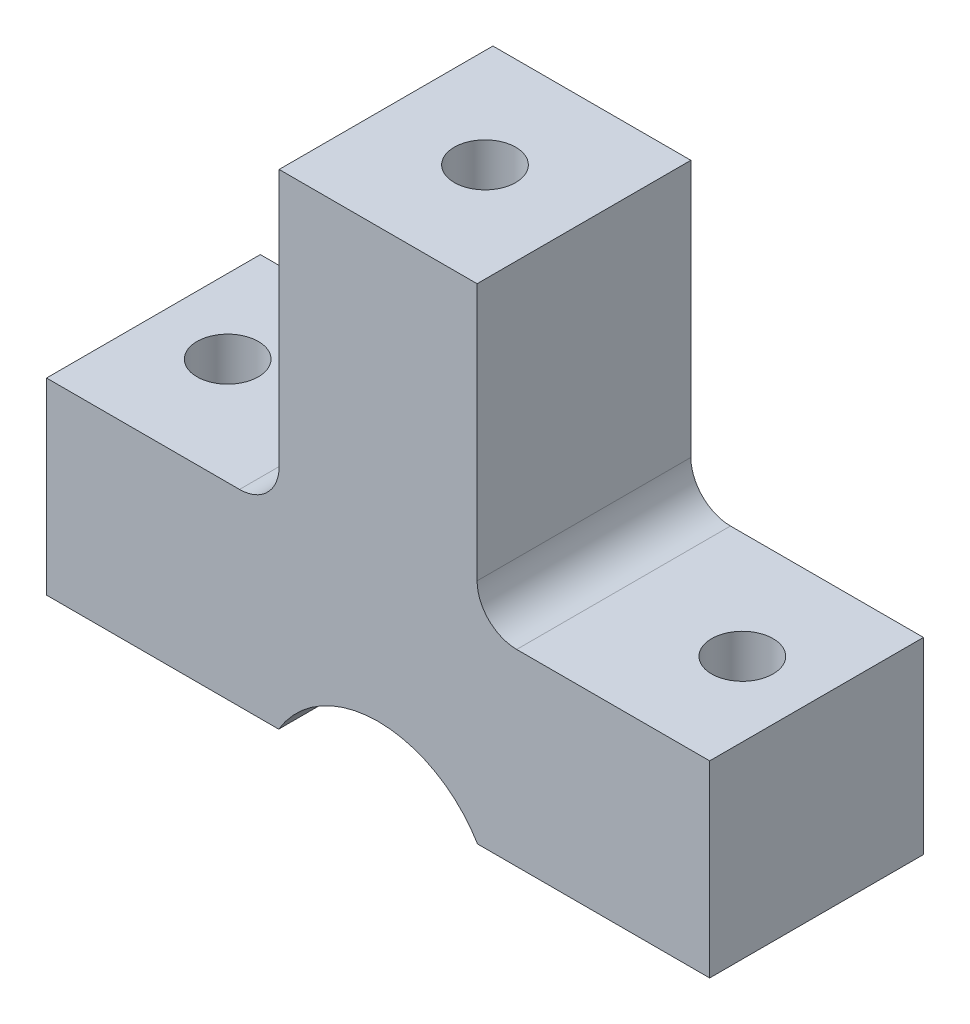
ISO-10303-21;
HEADER;
FILE_DESCRIPTION(('STEP AP214'),'2;1');
FILE_NAME('part.step','',(''),(''),'','','');
FILE_SCHEMA(('AUTOMOTIVE_DESIGN { 1 0 10303 214 1 1 1 1 }'));
ENDSEC;
DATA;
#1=APPLICATION_CONTEXT('core data for automotive mechanical design processes');
#2=APPLICATION_PROTOCOL_DEFINITION('international standard','automotive_design',2000,#1);
#3=PRODUCT_CONTEXT('',#1,'mechanical');
#4=PRODUCT('Part','Part','',(#3));
#5=PRODUCT_RELATED_PRODUCT_CATEGORY('part','',(#4));
#6=PRODUCT_DEFINITION_FORMATION('','',#4);
#7=PRODUCT_DEFINITION_CONTEXT('part definition',#1,'design');
#8=PRODUCT_DEFINITION('design','',#6,#7);
#9=PRODUCT_DEFINITION_SHAPE('','',#8);
#10=(LENGTH_UNIT() NAMED_UNIT(*) SI_UNIT(.MILLI.,.METRE.));
#11=(NAMED_UNIT(*) PLANE_ANGLE_UNIT() SI_UNIT($,.RADIAN.));
#12=(NAMED_UNIT(*) SI_UNIT($,.STERADIAN.) SOLID_ANGLE_UNIT());
#13=UNCERTAINTY_MEASURE_WITH_UNIT(LENGTH_MEASURE(1.E-05),#10,'distance_accuracy_value','');
#14=(GEOMETRIC_REPRESENTATION_CONTEXT(3) GLOBAL_UNCERTAINTY_ASSIGNED_CONTEXT((#13)) GLOBAL_UNIT_ASSIGNED_CONTEXT((#10,
#11,#12)) REPRESENTATION_CONTEXT('',''));
#15=CARTESIAN_POINT('',(0.,0.,0.));
#16=DIRECTION('',(0.,0.,1.));
#17=DIRECTION('',(1.,0.,0.));
#18=AXIS2_PLACEMENT_3D('',#15,#16,#17);
#19=CARTESIAN_POINT('',(4.4,-12.5,1.99999999999999));
#20=DIRECTION('',(0.,0.,1.));
#21=DIRECTION('',(0.,1.,0.));
#22=AXIS2_PLACEMENT_3D('',#19,#20,#21);
#23=PLANE('',#22);
#24=DIRECTION('',(1.,0.,0.));
#25=VECTOR('',#24,1.);
#26=CARTESIAN_POINT('',(-12.35,-9.5,1.99999999999999));
#27=LINE('',#26,#25);
#28=CARTESIAN_POINT('',(-2.85413675084775,-9.5,2.));
#29=VERTEX_POINT('',#28);
#30=CARTESIAN_POINT('',(11.6541367508478,-9.5,2.));
#31=VERTEX_POINT('',#30);
#32=EDGE_CURVE('E170',#29,#31,#27,.T.);
#33=ORIENTED_EDGE('',*,*,#32,.T.);
#34=CARTESIAN_POINT('',(4.4,-12.5,2.));
#35=DIRECTION('',(0.,0.,-1.));
#36=DIRECTION('',(1.,0.,0.));
#37=AXIS2_PLACEMENT_3D('',#34,#35,#36);
#38=CIRCLE('',#37,7.85);
#39=EDGE_CURVE('E176',#29,#31,#38,.T.);
#40=ORIENTED_EDGE('',*,*,#39,.F.);
#41=EDGE_LOOP('',(#33,#40));
#42=FACE_BOUND('',#41,.T.);
#43=ADVANCED_FACE('F33',(#42),#23,.T.);
#44=CARTESIAN_POINT('',(4.4,-12.5,5.8));
#45=DIRECTION('',(0.,0.,1.));
#46=DIRECTION('',(1.,0.,0.));
#47=AXIS2_PLACEMENT_3D('',#44,#45,#46);
#48=PLANE('',#47);
#49=CARTESIAN_POINT('',(4.4,-12.5,5.80000000002201));
#50=DIRECTION('',(0.,0.,1.));
#51=DIRECTION('',(1.,0.,0.));
#52=AXIS2_PLACEMENT_3D('',#49,#50,#51);
#53=CIRCLE('',#52,7.85);
#54=CARTESIAN_POINT('',(-2.85413675084775,-9.5,5.80000000024938));
#55=VERTEX_POINT('',#54);
#56=CARTESIAN_POINT('',(11.6541367508478,-9.5,5.8000000001357));
#57=VERTEX_POINT('',#56);
#58=EDGE_CURVE('E360',#55,#57,#53,.F.);
#59=ORIENTED_EDGE('',*,*,#58,.T.);
#60=DIRECTION('',(1.,0.,0.));
#61=VECTOR('',#60,1.);
#62=CARTESIAN_POINT('',(-12.35,-9.5,5.8));
#63=LINE('',#62,#61);
#64=CARTESIAN_POINT('',(9.42220071283497,-9.5,5.8));
#65=VERTEX_POINT('',#64);
#66=EDGE_CURVE('E172',#65,#57,#63,.T.);
#67=ORIENTED_EDGE('',*,*,#66,.F.);
#68=CARTESIAN_POINT('',(4.4,-12.5,5.8));
#69=DIRECTION('',(0.,0.,1.));
#70=DIRECTION('',(1.,0.,0.));
#71=AXIS2_PLACEMENT_3D('',#68,#69,#70);
#72=CIRCLE('',#71,5.85);
#73=CARTESIAN_POINT('',(-0.62220071283496,-9.5,5.8));
#74=VERTEX_POINT('',#73);
#75=EDGE_CURVE('E340',#65,#74,#72,.T.);
#76=ORIENTED_EDGE('',*,*,#75,.T.);
#77=EDGE_CURVE('E218',#55,#74,#63,.T.);
#78=ORIENTED_EDGE('',*,*,#77,.F.);
#79=EDGE_LOOP('',(#59,#67,#76,#78));
#80=FACE_BOUND('',#79,.T.);
#81=ADVANCED_FACE('F365',(#80),#48,.F.);
#82=CARTESIAN_POINT('',(0.,0.,0.));
#83=DIRECTION('',(0.,0.,1.));
#84=DIRECTION('',(1.,0.,0.));
#85=AXIS2_PLACEMENT_3D('',#82,#83,#84);
#86=PLANE('',#85);
#87=DIRECTION('',(-1.,0.,0.));
#88=VECTOR('',#87,1.);
#89=CARTESIAN_POINT('',(21.15,0.,0.));
#90=LINE('',#89,#88);
#91=CARTESIAN_POINT('',(21.15,0.,0.));
#92=VERTEX_POINT('',#91);
#93=CARTESIAN_POINT('',(11.4,0.,0.));
#94=VERTEX_POINT('',#93);
#95=EDGE_CURVE('E199',#92,#94,#90,.T.);
#96=ORIENTED_EDGE('',*,*,#95,.F.);
#97=DIRECTION('',(0.,1.,0.));
#98=VECTOR('',#97,1.);
#99=CARTESIAN_POINT('',(21.15,-9.5,0.));
#100=LINE('',#99,#98);
#101=CARTESIAN_POINT('',(21.15,-9.5,0.));
#102=VERTEX_POINT('',#101);
#103=EDGE_CURVE('E264',#102,#92,#100,.T.);
#104=ORIENTED_EDGE('',*,*,#103,.F.);
#105=DIRECTION('',(1.,0.,0.));
#106=VECTOR('',#105,1.);
#107=CARTESIAN_POINT('',(-12.35,-9.5,0.));
#108=LINE('',#107,#106);
#109=CARTESIAN_POINT('',(-12.35,-9.5,0.));
#110=VERTEX_POINT('',#109);
#111=EDGE_CURVE('E257',#110,#102,#108,.T.);
#112=ORIENTED_EDGE('',*,*,#111,.F.);
#113=DIRECTION('',(0.,-1.,0.));
#114=VECTOR('',#113,1.);
#115=CARTESIAN_POINT('',(-12.35,0.,0.));
#116=LINE('',#115,#114);
#117=CARTESIAN_POINT('',(-12.35,0.,0.));
#118=VERTEX_POINT('',#117);
#119=EDGE_CURVE('E255',#118,#110,#116,.T.);
#120=ORIENTED_EDGE('',*,*,#119,.F.);
#121=CARTESIAN_POINT('',(-2.6,0.,0.));
#122=VERTEX_POINT('',#121);
#123=EDGE_CURVE('E216',#122,#118,#90,.T.);
#124=ORIENTED_EDGE('',*,*,#123,.F.);
#125=CARTESIAN_POINT('',(-2.6,2.,0.));
#126=DIRECTION('',(0.,0.,1.));
#127=DIRECTION('',(1.,0.,0.));
#128=AXIS2_PLACEMENT_3D('',#125,#126,#127);
#129=CIRCLE('',#128,2.);
#130=CARTESIAN_POINT('',(-0.600000000000003,2.,0.));
#131=VERTEX_POINT('',#130);
#132=EDGE_CURVE('E11',#122,#131,#129,.T.);
#133=ORIENTED_EDGE('',*,*,#132,.T.);
#134=DIRECTION('',(0.,-1.,0.));
#135=VECTOR('',#134,1.);
#136=CARTESIAN_POINT('',(-0.600000000000003,29.7186955943793,0.));
#137=LINE('',#136,#135);
#138=CARTESIAN_POINT('',(-0.600000000000003,15.,0.));
#139=VERTEX_POINT('',#138);
#140=EDGE_CURVE('E307',#139,#131,#137,.T.);
#141=ORIENTED_EDGE('',*,*,#140,.F.);
#142=DIRECTION('',(-1.,0.,0.));
#143=VECTOR('',#142,1.);
#144=CARTESIAN_POINT('',(-0.600000000000003,15.,0.));
#145=LINE('',#144,#143);
#146=CARTESIAN_POINT('',(9.4,15.,0.));
#147=VERTEX_POINT('',#146);
#148=EDGE_CURVE('E295',#147,#139,#145,.T.);
#149=ORIENTED_EDGE('',*,*,#148,.F.);
#150=DIRECTION('',(0.,-1.,0.));
#151=VECTOR('',#150,1.);
#152=CARTESIAN_POINT('',(9.4,29.7186955943793,0.));
#153=LINE('',#152,#151);
#154=CARTESIAN_POINT('',(9.4,2.,0.));
#155=VERTEX_POINT('',#154);
#156=EDGE_CURVE('E239',#147,#155,#153,.T.);
#157=ORIENTED_EDGE('',*,*,#156,.T.);
#158=CARTESIAN_POINT('',(11.4,2.,0.));
#159=DIRECTION('',(0.,0.,1.));
#160=DIRECTION('',(1.,0.,0.));
#161=AXIS2_PLACEMENT_3D('',#158,#159,#160);
#162=CIRCLE('',#161,2.);
#163=EDGE_CURVE('E220',#155,#94,#162,.T.);
#164=ORIENTED_EDGE('',*,*,#163,.T.);
#165=EDGE_LOOP('',(#96,#104,#112,#120,#124,#133,#141,#149,#157,#164));
#166=FACE_BOUND('',#165,.T.);
#167=DIRECTION('',(-1.,0.,0.));
#168=VECTOR('',#167,1.);
#169=CARTESIAN_POINT('',(1.55,9.25,0.));
#170=LINE('',#169,#168);
#171=CARTESIAN_POINT('',(7.25,9.25,0.));
#172=VERTEX_POINT('',#171);
#173=CARTESIAN_POINT('',(1.55,9.25,0.));
#174=VERTEX_POINT('',#173);
#175=EDGE_CURVE('E345',#172,#174,#170,.T.);
#176=ORIENTED_EDGE('',*,*,#175,.F.);
#177=DIRECTION('',(0.,1.,0.));
#178=VECTOR('',#177,1.);
#179=CARTESIAN_POINT('',(7.25,9.25,0.));
#180=LINE('',#179,#178);
#181=CARTESIAN_POINT('',(7.25,12.,0.));
#182=VERTEX_POINT('',#181);
#183=EDGE_CURVE('E315',#172,#182,#180,.T.);
#184=ORIENTED_EDGE('',*,*,#183,.T.);
#185=DIRECTION('',(-1.,0.,0.));
#186=VECTOR('',#185,1.);
#187=CARTESIAN_POINT('',(1.55,12.,0.));
#188=LINE('',#187,#186);
#189=CARTESIAN_POINT('',(1.55,12.,0.));
#190=VERTEX_POINT('',#189);
#191=EDGE_CURVE('E331',#182,#190,#188,.T.);
#192=ORIENTED_EDGE('',*,*,#191,.T.);
#193=DIRECTION('',(0.,1.,0.));
#194=VECTOR('',#193,1.);
#195=CARTESIAN_POINT('',(1.55,9.25,0.));
#196=LINE('',#195,#194);
#197=EDGE_CURVE('E319',#174,#190,#196,.T.);
#198=ORIENTED_EDGE('',*,*,#197,.F.);
#199=EDGE_LOOP('',(#176,#184,#192,#198));
#200=FACE_BOUND('',#199,.T.);
#201=ADVANCED_FACE('F246',(#166,#200),#86,.F.);
#202=CARTESIAN_POINT('',(21.15,0.,45.6209706929603));
#203=DIRECTION('',(0.,-1.,0.));
#204=DIRECTION('',(0.,0.,-1.));
#205=AXIS2_PLACEMENT_3D('',#202,#203,#204);
#206=PLANE('',#205);
#207=CARTESIAN_POINT('',(-8.6,0.,5.4));
#208=DIRECTION('',(0.,1.,0.));
#209=DIRECTION('',(0.,0.,1.));
#210=AXIS2_PLACEMENT_3D('',#207,#208,#209);
#211=CIRCLE('',#210,1.55);
#212=CARTESIAN_POINT('',(-8.6,0.,6.95));
#213=VERTEX_POINT('',#212);
#214=EDGE_CURVE('E290',#213,#213,#211,.T.);
#215=ORIENTED_EDGE('',*,*,#214,.F.);
#216=EDGE_LOOP('',(#215));
#217=FACE_BOUND('',#216,.T.);
#218=DIRECTION('',(1.,0.,0.));
#219=VECTOR('',#218,1.);
#220=CARTESIAN_POINT('',(21.15,0.,10.8));
#221=LINE('',#220,#219);
#222=CARTESIAN_POINT('',(-12.35,0.,10.8));
#223=VERTEX_POINT('',#222);
#224=CARTESIAN_POINT('',(-2.6,0.,10.8));
#225=VERTEX_POINT('',#224);
#226=EDGE_CURVE('E182',#223,#225,#221,.T.);
#227=ORIENTED_EDGE('',*,*,#226,.T.);
#228=DIRECTION('',(0.,0.,1.));
#229=VECTOR('',#228,1.);
#230=CARTESIAN_POINT('',(-2.6,0.,0.));
#231=LINE('',#230,#229);
#232=EDGE_CURVE('E56',#225,#122,#231,.F.);
#233=ORIENTED_EDGE('',*,*,#232,.T.);
#234=ORIENTED_EDGE('',*,*,#123,.T.);
#235=DIRECTION('',(0.,0.,-1.));
#236=VECTOR('',#235,1.);
#237=CARTESIAN_POINT('',(-12.35,0.,45.6209706929603));
#238=LINE('',#237,#236);
#239=EDGE_CURVE('E272',#223,#118,#238,.T.);
#240=ORIENTED_EDGE('',*,*,#239,.F.);
#241=EDGE_LOOP('',(#227,#233,#234,#240));
#242=FACE_BOUND('',#241,.T.);
#243=ADVANCED_FACE('F381',(#217,#242),#206,.F.);
#244=CARTESIAN_POINT('',(17.4,0.,5.39999999999999));
#245=DIRECTION('',(0.,1.,0.));
#246=DIRECTION('',(0.,0.,1.));
#247=AXIS2_PLACEMENT_3D('',#244,#245,#246);
#248=CIRCLE('',#247,1.55);
#249=CARTESIAN_POINT('',(17.4,0.,6.94999999999999));
#250=VERTEX_POINT('',#249);
#251=EDGE_CURVE('E284',#250,#250,#248,.T.);
#252=ORIENTED_EDGE('',*,*,#251,.F.);
#253=EDGE_LOOP('',(#252));
#254=FACE_BOUND('',#253,.T.);
#255=ORIENTED_EDGE('',*,*,#95,.T.);
#256=DIRECTION('',(0.,0.,-1.));
#257=VECTOR('',#256,1.);
#258=CARTESIAN_POINT('',(11.4,0.,10.8));
#259=LINE('',#258,#257);
#260=CARTESIAN_POINT('',(11.4,0.,10.8));
#261=VERTEX_POINT('',#260);
#262=EDGE_CURVE('E185',#94,#261,#259,.F.);
#263=ORIENTED_EDGE('',*,*,#262,.T.);
#264=CARTESIAN_POINT('',(21.15,0.,10.8));
#265=VERTEX_POINT('',#264);
#266=EDGE_CURVE('E187',#261,#265,#221,.T.);
#267=ORIENTED_EDGE('',*,*,#266,.T.);
#268=DIRECTION('',(0.,0.,-1.));
#269=VECTOR('',#268,1.);
#270=CARTESIAN_POINT('',(21.15,0.,45.6209706929603));
#271=LINE('',#270,#269);
#272=EDGE_CURVE('E253',#265,#92,#271,.T.);
#273=ORIENTED_EDGE('',*,*,#272,.T.);
#274=EDGE_LOOP('',(#255,#263,#267,#273));
#275=FACE_BOUND('',#274,.T.);
#276=ADVANCED_FACE('F251',(#254,#275),#206,.F.);
#277=CARTESIAN_POINT('',(21.15,-9.5,45.6209706929603));
#278=DIRECTION('',(-1.,0.,0.));
#279=DIRECTION('',(0.,0.,1.));
#280=AXIS2_PLACEMENT_3D('',#277,#278,#279);
#281=PLANE('',#280);
#282=ORIENTED_EDGE('',*,*,#272,.F.);
#283=DIRECTION('',(0.,-1.,0.));
#284=VECTOR('',#283,1.);
#285=CARTESIAN_POINT('',(21.15,-9.5,10.8));
#286=LINE('',#285,#284);
#287=CARTESIAN_POINT('',(21.15,-9.5,10.8));
#288=VERTEX_POINT('',#287);
#289=EDGE_CURVE('E195',#265,#288,#286,.T.);
#290=ORIENTED_EDGE('',*,*,#289,.T.);
#291=DIRECTION('',(0.,0.,-1.));
#292=VECTOR('',#291,1.);
#293=CARTESIAN_POINT('',(21.15,-9.5,45.6209706929603));
#294=LINE('',#293,#292);
#295=EDGE_CURVE('E269',#288,#102,#294,.T.);
#296=ORIENTED_EDGE('',*,*,#295,.T.);
#297=ORIENTED_EDGE('',*,*,#103,.T.);
#298=EDGE_LOOP('',(#282,#290,#296,#297));
#299=FACE_BOUND('',#298,.T.);
#300=ADVANCED_FACE('F373',(#299),#281,.F.);
#301=CARTESIAN_POINT('',(-12.35,-9.5,45.6209706929603));
#302=DIRECTION('',(0.,1.,0.));
#303=DIRECTION('',(0.,0.,1.));
#304=AXIS2_PLACEMENT_3D('',#301,#302,#303);
#305=PLANE('',#304);
#306=ORIENTED_EDGE('',*,*,#32,.F.);
#307=DIRECTION('',(0.,0.,-1.));
#308=VECTOR('',#307,1.);
#309=CARTESIAN_POINT('',(-2.85413675084775,-9.5,500000.));
#310=LINE('',#309,#308);
#311=EDGE_CURVE('E175',#55,#29,#310,.T.);
#312=ORIENTED_EDGE('',*,*,#311,.F.);
#313=ORIENTED_EDGE('',*,*,#77,.T.);
#314=DIRECTION('',(0.,0.,1.));
#315=VECTOR('',#314,1.);
#316=CARTESIAN_POINT('',(-0.62220071283496,-9.5,-5.14132076122441));
#317=LINE('',#316,#315);
#318=CARTESIAN_POINT('',(-0.62220071283496,-9.5,10.8));
#319=VERTEX_POINT('',#318);
#320=EDGE_CURVE('E352',#74,#319,#317,.T.);
#321=ORIENTED_EDGE('',*,*,#320,.T.);
#322=DIRECTION('',(-1.,0.,0.));
#323=VECTOR('',#322,1.);
#324=CARTESIAN_POINT('',(-12.35,-9.5,10.8));
#325=LINE('',#324,#323);
#326=CARTESIAN_POINT('',(-12.35,-9.5,10.8));
#327=VERTEX_POINT('',#326);
#328=EDGE_CURVE('E276',#319,#327,#325,.T.);
#329=ORIENTED_EDGE('',*,*,#328,.T.);
#330=DIRECTION('',(0.,0.,-1.));
#331=VECTOR('',#330,1.);
#332=CARTESIAN_POINT('',(-12.35,-9.5,45.6209706929603));
#333=LINE('',#332,#331);
#334=EDGE_CURVE('E271',#327,#110,#333,.T.);
#335=ORIENTED_EDGE('',*,*,#334,.T.);
#336=ORIENTED_EDGE('',*,*,#111,.T.);
#337=ORIENTED_EDGE('',*,*,#295,.F.);
#338=CARTESIAN_POINT('',(9.42220071283497,-9.5,10.8));
#339=VERTEX_POINT('',#338);
#340=EDGE_CURVE('E278',#288,#339,#325,.T.);
#341=ORIENTED_EDGE('',*,*,#340,.T.);
#342=DIRECTION('',(0.,0.,1.));
#343=VECTOR('',#342,1.);
#344=CARTESIAN_POINT('',(9.42220071283497,-9.5,-5.14132076122441));
#345=LINE('',#344,#343);
#346=EDGE_CURVE('E354',#65,#339,#345,.T.);
#347=ORIENTED_EDGE('',*,*,#346,.F.);
#348=ORIENTED_EDGE('',*,*,#66,.T.);
#349=DIRECTION('',(0.,0.,-1.));
#350=VECTOR('',#349,1.);
#351=CARTESIAN_POINT('',(11.6541367508478,-9.5,500000.));
#352=LINE('',#351,#350);
#353=EDGE_CURVE('E164',#57,#31,#352,.T.);
#354=ORIENTED_EDGE('',*,*,#353,.T.);
#355=EDGE_LOOP('',(#306,#312,#313,#321,#329,#335,#336,#337,#341,#347,#348,#354));
#356=FACE_BOUND('',#355,.T.);
#357=CARTESIAN_POINT('',(-8.6,-9.5,5.4));
#358=DIRECTION('',(0.,1.,0.));
#359=DIRECTION('',(0.,0.,1.));
#360=AXIS2_PLACEMENT_3D('',#357,#358,#359);
#361=CIRCLE('',#360,1.55);
#362=CARTESIAN_POINT('',(-8.6,-9.5,6.95));
#363=VERTEX_POINT('',#362);
#364=EDGE_CURVE('E287',#363,#363,#361,.T.);
#365=ORIENTED_EDGE('',*,*,#364,.T.);
#366=EDGE_LOOP('',(#365));
#367=FACE_BOUND('',#366,.T.);
#368=CARTESIAN_POINT('',(17.4,-9.5,5.39999999999999));
#369=DIRECTION('',(0.,1.,0.));
#370=DIRECTION('',(0.,0.,1.));
#371=AXIS2_PLACEMENT_3D('',#368,#369,#370);
#372=CIRCLE('',#371,1.55);
#373=CARTESIAN_POINT('',(17.4,-9.5,6.94999999999999));
#374=VERTEX_POINT('',#373);
#375=EDGE_CURVE('E283',#374,#374,#372,.T.);
#376=ORIENTED_EDGE('',*,*,#375,.T.);
#377=EDGE_LOOP('',(#376));
#378=FACE_BOUND('',#377,.T.);
#379=ADVANCED_FACE('F166',(#356,#367,#378),#305,.F.);
#380=CARTESIAN_POINT('',(-12.35,0.,45.6209706929603));
#381=DIRECTION('',(1.,0.,0.));
#382=DIRECTION('',(0.,0.,-1.));
#383=AXIS2_PLACEMENT_3D('',#380,#381,#382);
#384=PLANE('',#383);
#385=ORIENTED_EDGE('',*,*,#334,.F.);
#386=DIRECTION('',(0.,1.,0.));
#387=VECTOR('',#386,1.);
#388=CARTESIAN_POINT('',(-12.35,0.,10.8));
#389=LINE('',#388,#387);
#390=EDGE_CURVE('E204',#327,#223,#389,.T.);
#391=ORIENTED_EDGE('',*,*,#390,.T.);
#392=ORIENTED_EDGE('',*,*,#239,.T.);
#393=ORIENTED_EDGE('',*,*,#119,.T.);
#394=EDGE_LOOP('',(#385,#391,#392,#393));
#395=FACE_BOUND('',#394,.T.);
#396=ADVANCED_FACE('F372',(#395),#384,.F.);
#397=CARTESIAN_POINT('',(21.15,-25.,10.8));
#398=DIRECTION('',(0.,0.,-1.));
#399=DIRECTION('',(1.,0.,0.));
#400=AXIS2_PLACEMENT_3D('',#397,#398,#399);
#401=PLANE('',#400);
#402=ORIENTED_EDGE('',*,*,#328,.F.);
#403=CARTESIAN_POINT('',(4.4,-12.5,10.8));
#404=DIRECTION('',(0.,0.,-1.));
#405=DIRECTION('',(1.,0.,0.));
#406=AXIS2_PLACEMENT_3D('',#403,#404,#405);
#407=CIRCLE('',#406,5.85);
#408=EDGE_CURVE('E355',#319,#339,#407,.T.);
#409=ORIENTED_EDGE('',*,*,#408,.T.);
#410=ORIENTED_EDGE('',*,*,#340,.F.);
#411=ORIENTED_EDGE('',*,*,#289,.F.);
#412=ORIENTED_EDGE('',*,*,#266,.F.);
#413=CARTESIAN_POINT('',(11.4,2.,10.8));
#414=DIRECTION('',(0.,0.,-1.));
#415=DIRECTION('',(-1.,0.,0.));
#416=AXIS2_PLACEMENT_3D('',#413,#414,#415);
#417=CIRCLE('',#416,2.);
#418=CARTESIAN_POINT('',(9.4,2.,10.8));
#419=VERTEX_POINT('',#418);
#420=EDGE_CURVE('E222',#261,#419,#417,.T.);
#421=ORIENTED_EDGE('',*,*,#420,.T.);
#422=DIRECTION('',(0.,-1.,0.));
#423=VECTOR('',#422,1.);
#424=CARTESIAN_POINT('',(9.4,29.7186955943793,10.8));
#425=LINE('',#424,#423);
#426=CARTESIAN_POINT('',(9.4,15.,10.8));
#427=VERTEX_POINT('',#426);
#428=EDGE_CURVE('E228',#427,#419,#425,.T.);
#429=ORIENTED_EDGE('',*,*,#428,.F.);
#430=DIRECTION('',(1.,0.,0.));
#431=VECTOR('',#430,1.);
#432=CARTESIAN_POINT('',(-0.600000000000002,15.,10.8));
#433=LINE('',#432,#431);
#434=CARTESIAN_POINT('',(-0.600000000000002,15.,10.8));
#435=VERTEX_POINT('',#434);
#436=EDGE_CURVE('E301',#435,#427,#433,.T.);
#437=ORIENTED_EDGE('',*,*,#436,.F.);
#438=DIRECTION('',(0.,-1.,0.));
#439=VECTOR('',#438,1.);
#440=CARTESIAN_POINT('',(-0.600000000000002,29.7186955943793,10.8));
#441=LINE('',#440,#439);
#442=CARTESIAN_POINT('',(-0.600000000000002,2.,10.8));
#443=VERTEX_POINT('',#442);
#444=EDGE_CURVE('E240',#435,#443,#441,.T.);
#445=ORIENTED_EDGE('',*,*,#444,.T.);
#446=CARTESIAN_POINT('',(-2.6,2.,10.8));
#447=DIRECTION('',(0.,0.,-1.));
#448=DIRECTION('',(-1.,0.,0.));
#449=AXIS2_PLACEMENT_3D('',#446,#447,#448);
#450=CIRCLE('',#449,2.);
#451=EDGE_CURVE('E42',#443,#225,#450,.T.);
#452=ORIENTED_EDGE('',*,*,#451,.T.);
#453=ORIENTED_EDGE('',*,*,#226,.F.);
#454=ORIENTED_EDGE('',*,*,#390,.F.);
#455=EDGE_LOOP('',(#402,#409,#410,#411,#412,#421,#429,#437,#445,#452,#453,#454));
#456=FACE_BOUND('',#455,.T.);
#457=ADVANCED_FACE('F227',(#456),#401,.F.);
#458=CARTESIAN_POINT('',(17.4,-9.5,5.39999999999999));
#459=DIRECTION('',(0.,1.,0.));
#460=DIRECTION('',(0.,0.,1.));
#461=AXIS2_PLACEMENT_3D('',#458,#459,#460);
#462=CYLINDRICAL_SURFACE('',#461,1.55);
#463=ORIENTED_EDGE('',*,*,#375,.F.);
#464=EDGE_LOOP('',(#463));
#465=FACE_BOUND('',#464,.T.);
#466=ORIENTED_EDGE('',*,*,#251,.T.);
#467=EDGE_LOOP('',(#466));
#468=FACE_BOUND('',#467,.T.);
#469=ADVANCED_FACE('F392',(#465,#468),#462,.F.);
#470=CARTESIAN_POINT('',(-8.6,-9.5,5.4));
#471=DIRECTION('',(0.,1.,0.));
#472=DIRECTION('',(0.,0.,1.));
#473=AXIS2_PLACEMENT_3D('',#470,#471,#472);
#474=CYLINDRICAL_SURFACE('',#473,1.55);
#475=ORIENTED_EDGE('',*,*,#364,.F.);
#476=EDGE_LOOP('',(#475));
#477=FACE_BOUND('',#476,.T.);
#478=ORIENTED_EDGE('',*,*,#214,.T.);
#479=EDGE_LOOP('',(#478));
#480=FACE_BOUND('',#479,.T.);
#481=ADVANCED_FACE('F449',(#477,#480),#474,.F.);
#482=CARTESIAN_POINT('',(-0.600000000000003,29.7186955943793,0.));
#483=DIRECTION('',(1.,0.,0.));
#484=DIRECTION('',(0.,0.,-1.));
#485=AXIS2_PLACEMENT_3D('',#482,#483,#484);
#486=PLANE('',#485);
#487=ORIENTED_EDGE('',*,*,#140,.T.);
#488=DIRECTION('',(0.,0.,1.));
#489=VECTOR('',#488,1.);
#490=CARTESIAN_POINT('',(-0.600000000000002,2.,10.8));
#491=LINE('',#490,#489);
#492=EDGE_CURVE('E213',#131,#443,#491,.T.);
#493=ORIENTED_EDGE('',*,*,#492,.T.);
#494=ORIENTED_EDGE('',*,*,#444,.F.);
#495=DIRECTION('',(0.,0.,1.));
#496=VECTOR('',#495,1.);
#497=CARTESIAN_POINT('',(-0.600000000000003,15.,0.));
#498=LINE('',#497,#496);
#499=EDGE_CURVE('E298',#139,#435,#498,.T.);
#500=ORIENTED_EDGE('',*,*,#499,.F.);
#501=EDGE_LOOP('',(#487,#493,#494,#500));
#502=FACE_BOUND('',#501,.T.);
#503=ADVANCED_FACE('F446',(#502),#486,.F.);
#504=CARTESIAN_POINT('',(9.4,29.7186955943793,0.));
#505=DIRECTION('',(-1.,0.,0.));
#506=DIRECTION('',(0.,0.,1.));
#507=AXIS2_PLACEMENT_3D('',#504,#505,#506);
#508=PLANE('',#507);
#509=ORIENTED_EDGE('',*,*,#428,.T.);
#510=DIRECTION('',(0.,0.,-1.));
#511=VECTOR('',#510,1.);
#512=CARTESIAN_POINT('',(9.4,2.,0.));
#513=LINE('',#512,#511);
#514=EDGE_CURVE('E181',#419,#155,#513,.T.);
#515=ORIENTED_EDGE('',*,*,#514,.T.);
#516=ORIENTED_EDGE('',*,*,#156,.F.);
#517=DIRECTION('',(0.,0.,-1.));
#518=VECTOR('',#517,1.);
#519=CARTESIAN_POINT('',(9.4,15.,0.));
#520=LINE('',#519,#518);
#521=EDGE_CURVE('E238',#427,#147,#520,.T.);
#522=ORIENTED_EDGE('',*,*,#521,.F.);
#523=EDGE_LOOP('',(#509,#515,#516,#522));
#524=FACE_BOUND('',#523,.T.);
#525=ADVANCED_FACE('F235',(#524),#508,.F.);
#526=CARTESIAN_POINT('',(0.,15.,-24.7));
#527=DIRECTION('',(0.,1.,0.));
#528=DIRECTION('',(1.,0.,0.));
#529=AXIS2_PLACEMENT_3D('',#526,#527,#528);
#530=PLANE('',#529);
#531=CARTESIAN_POINT('',(4.4,15.,5.39999999999999));
#532=DIRECTION('',(0.,1.,0.));
#533=DIRECTION('',(0.,0.,1.));
#534=AXIS2_PLACEMENT_3D('',#531,#532,#533);
#535=CIRCLE('',#534,1.55);
#536=CARTESIAN_POINT('',(4.4,15.,6.94999999999999));
#537=VERTEX_POINT('',#536);
#538=EDGE_CURVE('E304',#537,#537,#535,.T.);
#539=ORIENTED_EDGE('',*,*,#538,.F.);
#540=EDGE_LOOP('',(#539));
#541=FACE_BOUND('',#540,.T.);
#542=ORIENTED_EDGE('',*,*,#148,.T.);
#543=ORIENTED_EDGE('',*,*,#499,.T.);
#544=ORIENTED_EDGE('',*,*,#436,.T.);
#545=ORIENTED_EDGE('',*,*,#521,.T.);
#546=EDGE_LOOP('',(#542,#543,#544,#545));
#547=FACE_BOUND('',#546,.T.);
#548=ADVANCED_FACE('F442',(#541,#547),#530,.T.);
#549=CARTESIAN_POINT('',(4.4,12.,5.39999999999999));
#550=DIRECTION('',(0.,1.,0.));
#551=DIRECTION('',(0.,0.,1.));
#552=AXIS2_PLACEMENT_3D('',#549,#550,#551);
#553=CYLINDRICAL_SURFACE('',#552,1.55);
#554=CARTESIAN_POINT('',(4.4,12.,5.39999999999999));
#555=DIRECTION('',(0.,1.,0.));
#556=DIRECTION('',(0.,0.,1.));
#557=AXIS2_PLACEMENT_3D('',#554,#555,#556);
#558=CIRCLE('',#557,1.55);
#559=CARTESIAN_POINT('',(4.4,12.,6.94999999999999));
#560=VERTEX_POINT('',#559);
#561=EDGE_CURVE('E308',#560,#560,#558,.F.);
#562=ORIENTED_EDGE('',*,*,#561,.T.);
#563=EDGE_LOOP('',(#562));
#564=FACE_BOUND('',#563,.T.);
#565=ORIENTED_EDGE('',*,*,#538,.T.);
#566=EDGE_LOOP('',(#565));
#567=FACE_BOUND('',#566,.T.);
#568=ADVANCED_FACE('F428',(#564,#567),#553,.F.);
#569=CARTESIAN_POINT('',(0.,12.,0.));
#570=DIRECTION('',(0.,1.,0.));
#571=DIRECTION('',(0.,0.,1.));
#572=AXIS2_PLACEMENT_3D('',#569,#570,#571);
#573=PLANE('',#572);
#574=DIRECTION('',(0.866025403784438,0.,-0.5));
#575=VECTOR('',#574,1.);
#576=CARTESIAN_POINT('',(4.4,12.,8.69089653438086));
#577=LINE('',#576,#575);
#578=CARTESIAN_POINT('',(4.4,12.,8.69089653438086));
#579=VERTEX_POINT('',#578);
#580=CARTESIAN_POINT('',(7.25,12.,7.04544826719043));
#581=VERTEX_POINT('',#580);
#582=EDGE_CURVE('E337',#579,#581,#577,.T.);
#583=ORIENTED_EDGE('',*,*,#582,.F.);
#584=DIRECTION('',(0.866025403784438,0.,0.500000000000001));
#585=VECTOR('',#584,1.);
#586=CARTESIAN_POINT('',(1.55,12.,7.04544826719043));
#587=LINE('',#586,#585);
#588=CARTESIAN_POINT('',(1.55,12.,7.04544826719043));
#589=VERTEX_POINT('',#588);
#590=EDGE_CURVE('E324',#589,#579,#587,.T.);
#591=ORIENTED_EDGE('',*,*,#590,.F.);
#592=DIRECTION('',(0.,0.,1.));
#593=VECTOR('',#592,1.);
#594=CARTESIAN_POINT('',(1.55,12.,3.75455173280956));
#595=LINE('',#594,#593);
#596=EDGE_CURVE('E328',#190,#589,#595,.T.);
#597=ORIENTED_EDGE('',*,*,#596,.F.);
#598=ORIENTED_EDGE('',*,*,#191,.F.);
#599=DIRECTION('',(0.,0.,-1.));
#600=VECTOR('',#599,1.);
#601=CARTESIAN_POINT('',(7.25,12.,3.75455173280956));
#602=LINE('',#601,#600);
#603=EDGE_CURVE('E334',#581,#182,#602,.T.);
#604=ORIENTED_EDGE('',*,*,#603,.F.);
#605=EDGE_LOOP('',(#583,#591,#597,#598,#604));
#606=FACE_BOUND('',#605,.T.);
#607=ORIENTED_EDGE('',*,*,#561,.F.);
#608=EDGE_LOOP('',(#607));
#609=FACE_BOUND('',#608,.T.);
#610=ADVANCED_FACE('F424',(#606,#609),#573,.F.);
#611=CARTESIAN_POINT('',(4.4,9.25,8.69089653438086));
#612=DIRECTION('',(0.5,0.,0.866025403784438));
#613=DIRECTION('',(0.866025403784438,0.,-0.5));
#614=AXIS2_PLACEMENT_3D('',#611,#612,#613);
#615=PLANE('',#614);
#616=ORIENTED_EDGE('',*,*,#582,.T.);
#617=DIRECTION('',(0.,1.,0.));
#618=VECTOR('',#617,1.);
#619=CARTESIAN_POINT('',(7.25,9.25,7.04544826719043));
#620=LINE('',#619,#618);
#621=CARTESIAN_POINT('',(7.25,9.25,7.04544826719043));
#622=VERTEX_POINT('',#621);
#623=EDGE_CURVE('E312',#622,#581,#620,.T.);
#624=ORIENTED_EDGE('',*,*,#623,.F.);
#625=DIRECTION('',(0.866025403784438,0.,-0.5));
#626=VECTOR('',#625,1.);
#627=CARTESIAN_POINT('',(4.4,9.25,8.69089653438086));
#628=LINE('',#627,#626);
#629=CARTESIAN_POINT('',(4.4,9.25,8.69089653438086));
#630=VERTEX_POINT('',#629);
#631=EDGE_CURVE('E327',#630,#622,#628,.T.);
#632=ORIENTED_EDGE('',*,*,#631,.F.);
#633=DIRECTION('',(0.,1.,0.));
#634=VECTOR('',#633,1.);
#635=CARTESIAN_POINT('',(4.4,9.25,8.69089653438086));
#636=LINE('',#635,#634);
#637=EDGE_CURVE('E311',#630,#579,#636,.T.);
#638=ORIENTED_EDGE('',*,*,#637,.T.);
#639=EDGE_LOOP('',(#616,#624,#632,#638));
#640=FACE_BOUND('',#639,.T.);
#641=ADVANCED_FACE('F427',(#640),#615,.F.);
#642=CARTESIAN_POINT('',(1.55,9.25,7.04544826719043));
#643=DIRECTION('',(-0.500000000000001,0.,0.866025403784438));
#644=DIRECTION('',(0.866025403784438,0.,0.500000000000001));
#645=AXIS2_PLACEMENT_3D('',#642,#643,#644);
#646=PLANE('',#645);
#647=ORIENTED_EDGE('',*,*,#590,.T.);
#648=ORIENTED_EDGE('',*,*,#637,.F.);
#649=DIRECTION('',(0.866025403784438,0.,0.500000000000001));
#650=VECTOR('',#649,1.);
#651=CARTESIAN_POINT('',(1.55,9.25,7.04544826719043));
#652=LINE('',#651,#650);
#653=CARTESIAN_POINT('',(1.55,9.25,7.04544826719043));
#654=VERTEX_POINT('',#653);
#655=EDGE_CURVE('E316',#654,#630,#652,.T.);
#656=ORIENTED_EDGE('',*,*,#655,.F.);
#657=DIRECTION('',(0.,1.,0.));
#658=VECTOR('',#657,1.);
#659=CARTESIAN_POINT('',(1.55,9.25,7.04544826719043));
#660=LINE('',#659,#658);
#661=EDGE_CURVE('E321',#654,#589,#660,.T.);
#662=ORIENTED_EDGE('',*,*,#661,.T.);
#663=EDGE_LOOP('',(#647,#648,#656,#662));
#664=FACE_BOUND('',#663,.T.);
#665=ADVANCED_FACE('F430',(#664),#646,.F.);
#666=CARTESIAN_POINT('',(1.55,9.25,3.75455173280956));
#667=DIRECTION('',(-1.,0.,0.));
#668=DIRECTION('',(0.,0.,1.));
#669=AXIS2_PLACEMENT_3D('',#666,#667,#668);
#670=PLANE('',#669);
#671=ORIENTED_EDGE('',*,*,#596,.T.);
#672=ORIENTED_EDGE('',*,*,#661,.F.);
#673=DIRECTION('',(0.,0.,1.));
#674=VECTOR('',#673,1.);
#675=CARTESIAN_POINT('',(1.55,9.25,3.75455173280956));
#676=LINE('',#675,#674);
#677=EDGE_CURVE('E343',#174,#654,#676,.T.);
#678=ORIENTED_EDGE('',*,*,#677,.F.);
#679=ORIENTED_EDGE('',*,*,#197,.T.);
#680=EDGE_LOOP('',(#671,#672,#678,#679));
#681=FACE_BOUND('',#680,.T.);
#682=ADVANCED_FACE('F418',(#681),#670,.F.);
#683=CARTESIAN_POINT('',(7.25,9.25,3.75455173280956));
#684=DIRECTION('',(1.,0.,0.));
#685=DIRECTION('',(0.,0.,-1.));
#686=AXIS2_PLACEMENT_3D('',#683,#684,#685);
#687=PLANE('',#686);
#688=ORIENTED_EDGE('',*,*,#603,.T.);
#689=ORIENTED_EDGE('',*,*,#183,.F.);
#690=DIRECTION('',(0.,0.,-1.));
#691=VECTOR('',#690,1.);
#692=CARTESIAN_POINT('',(7.25,9.25,7.04544826719043));
#693=LINE('',#692,#691);
#694=EDGE_CURVE('E348',#622,#172,#693,.T.);
#695=ORIENTED_EDGE('',*,*,#694,.F.);
#696=ORIENTED_EDGE('',*,*,#623,.T.);
#697=EDGE_LOOP('',(#688,#689,#695,#696));
#698=FACE_BOUND('',#697,.T.);
#699=ADVANCED_FACE('F412',(#698),#687,.F.);
#700=CARTESIAN_POINT('',(0.,9.25,0.));
#701=DIRECTION('',(0.,1.,0.));
#702=DIRECTION('',(0.,0.,1.));
#703=AXIS2_PLACEMENT_3D('',#700,#701,#702);
#704=PLANE('',#703);
#705=ORIENTED_EDGE('',*,*,#631,.T.);
#706=ORIENTED_EDGE('',*,*,#694,.T.);
#707=ORIENTED_EDGE('',*,*,#175,.T.);
#708=ORIENTED_EDGE('',*,*,#677,.T.);
#709=ORIENTED_EDGE('',*,*,#655,.T.);
#710=EDGE_LOOP('',(#705,#706,#707,#708,#709));
#711=FACE_BOUND('',#710,.T.);
#712=ADVANCED_FACE('F406',(#711),#704,.T.);
#713=CARTESIAN_POINT('',(11.4,2.,0.));
#714=DIRECTION('',(0.,0.,1.));
#715=DIRECTION('',(1.,0.,0.));
#716=AXIS2_PLACEMENT_3D('',#713,#714,#715);
#717=CYLINDRICAL_SURFACE('',#716,2.);
#718=ORIENTED_EDGE('',*,*,#420,.F.);
#719=ORIENTED_EDGE('',*,*,#262,.F.);
#720=ORIENTED_EDGE('',*,*,#163,.F.);
#721=ORIENTED_EDGE('',*,*,#514,.F.);
#722=EDGE_LOOP('',(#718,#719,#720,#721));
#723=FACE_BOUND('',#722,.T.);
#724=ADVANCED_FACE('F242',(#723),#717,.F.);
#725=CARTESIAN_POINT('',(-2.6,2.,0.));
#726=DIRECTION('',(0.,0.,-1.));
#727=DIRECTION('',(-1.,0.,0.));
#728=AXIS2_PLACEMENT_3D('',#725,#726,#727);
#729=CYLINDRICAL_SURFACE('',#728,2.);
#730=ORIENTED_EDGE('',*,*,#132,.F.);
#731=ORIENTED_EDGE('',*,*,#232,.F.);
#732=ORIENTED_EDGE('',*,*,#451,.F.);
#733=ORIENTED_EDGE('',*,*,#492,.F.);
#734=EDGE_LOOP('',(#730,#731,#732,#733));
#735=FACE_BOUND('',#734,.T.);
#736=ADVANCED_FACE('F35',(#735),#729,.F.);
#737=CARTESIAN_POINT('',(4.4,-12.5,-5.14132076122441));
#738=DIRECTION('',(0.,0.,1.));
#739=DIRECTION('',(1.,0.,0.));
#740=AXIS2_PLACEMENT_3D('',#737,#738,#739);
#741=CYLINDRICAL_SURFACE('',#740,5.85);
#742=ORIENTED_EDGE('',*,*,#75,.F.);
#743=ORIENTED_EDGE('',*,*,#346,.T.);
#744=ORIENTED_EDGE('',*,*,#408,.F.);
#745=ORIENTED_EDGE('',*,*,#320,.F.);
#746=EDGE_LOOP('',(#742,#743,#744,#745));
#747=FACE_BOUND('',#746,.T.);
#748=ADVANCED_FACE('F370',(#747),#741,.F.);
#749=CARTESIAN_POINT('',(4.4,-12.5,500000.));
#750=DIRECTION('',(0.,0.,-1.));
#751=DIRECTION('',(-1.,0.,0.));
#752=AXIS2_PLACEMENT_3D('',#749,#750,#751);
#753=CYLINDRICAL_SURFACE('',#752,7.85);
#754=ORIENTED_EDGE('',*,*,#58,.F.);
#755=ORIENTED_EDGE('',*,*,#311,.T.);
#756=ORIENTED_EDGE('',*,*,#39,.T.);
#757=ORIENTED_EDGE('',*,*,#353,.F.);
#758=EDGE_LOOP('',(#754,#755,#756,#757));
#759=FACE_BOUND('',#758,.T.);
#760=ADVANCED_FACE('F178',(#759),#753,.F.);
#761=CLOSED_SHELL('',(#43,#81,#201,#243,#276,#300,#379,#396,#457,#469,#481,#503,#525,#548,#568,
#610,#641,#665,#682,#699,#712,#724,#736,#748,#760));
#762=MANIFOLD_SOLID_BREP('B2',#761);
#763=ADVANCED_BREP_SHAPE_REPRESENTATION('',(#18,#762),#14);
#764=SHAPE_DEFINITION_REPRESENTATION(#9,#763);
ENDSEC;
END-ISO-10303-21;
